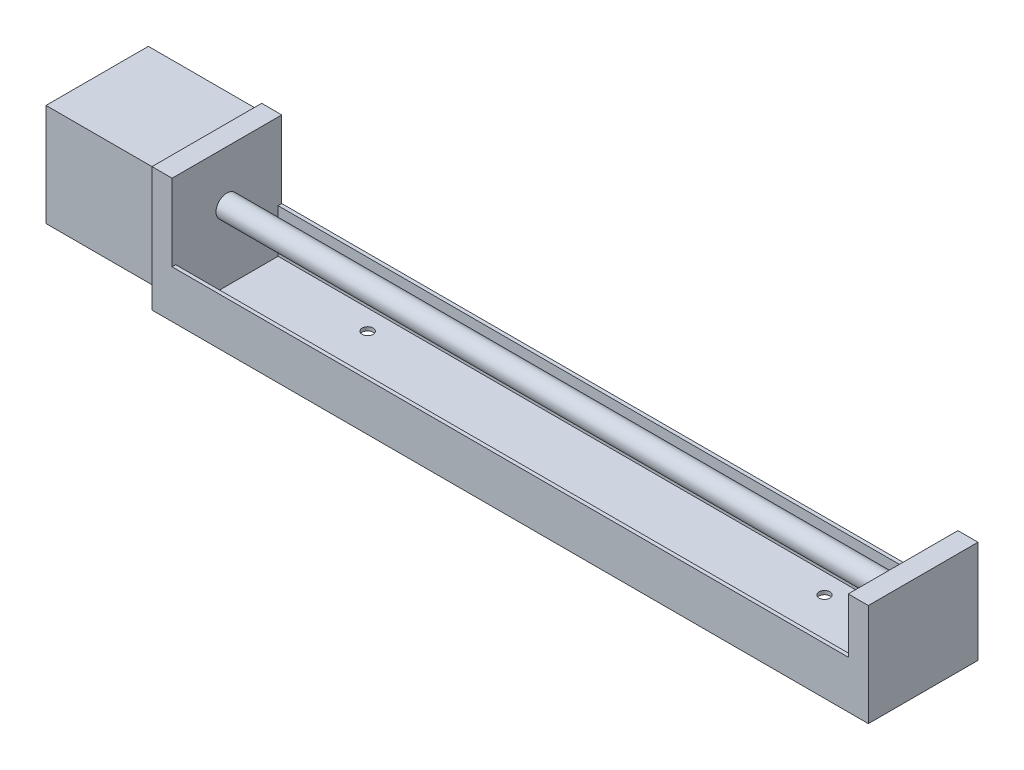
ISO-10303-21;
HEADER;
FILE_DESCRIPTION(('STEP AP214'),'2;1');
FILE_NAME('part.step','',(''),(''),'','','');
FILE_SCHEMA(('AUTOMOTIVE_DESIGN { 1 0 10303 214 1 1 1 1 }'));
ENDSEC;
DATA;
#1=APPLICATION_CONTEXT('core data for automotive mechanical design processes');
#2=APPLICATION_PROTOCOL_DEFINITION('international standard','automotive_design',2000,#1);
#3=PRODUCT_CONTEXT('',#1,'mechanical');
#4=PRODUCT('Part','Part','',(#3));
#5=PRODUCT_RELATED_PRODUCT_CATEGORY('part','',(#4));
#6=PRODUCT_DEFINITION_FORMATION('','',#4);
#7=PRODUCT_DEFINITION_CONTEXT('part definition',#1,'design');
#8=PRODUCT_DEFINITION('design','',#6,#7);
#9=PRODUCT_DEFINITION_SHAPE('','',#8);
#10=(LENGTH_UNIT() NAMED_UNIT(*) SI_UNIT(.MILLI.,.METRE.));
#11=(NAMED_UNIT(*) PLANE_ANGLE_UNIT() SI_UNIT($,.RADIAN.));
#12=(NAMED_UNIT(*) SI_UNIT($,.STERADIAN.) SOLID_ANGLE_UNIT());
#13=UNCERTAINTY_MEASURE_WITH_UNIT(LENGTH_MEASURE(1.E-05),#10,'distance_accuracy_value','');
#14=(GEOMETRIC_REPRESENTATION_CONTEXT(3) GLOBAL_UNCERTAINTY_ASSIGNED_CONTEXT((#13)) GLOBAL_UNIT_ASSIGNED_CONTEXT((#10,
#11,#12)) REPRESENTATION_CONTEXT('',''));
#15=CARTESIAN_POINT('',(0.,0.,0.));
#16=DIRECTION('',(0.,0.,1.));
#17=DIRECTION('',(1.,0.,0.));
#18=AXIS2_PLACEMENT_3D('',#15,#16,#17);
#19=CARTESIAN_POINT('',(-15.,14.,14.));
#20=DIRECTION('',(0.,-1.,0.));
#21=DIRECTION('',(0.,0.,-1.));
#22=AXIS2_PLACEMENT_3D('',#19,#20,#21);
#23=PLANE('',#22);
#24=DIRECTION('',(-1.,0.,0.));
#25=VECTOR('',#24,1.);
#26=CARTESIAN_POINT('',(-15.,14.,-14.));
#27=LINE('',#26,#25);
#28=CARTESIAN_POINT('',(15.,14.,-14.));
#29=VERTEX_POINT('',#28);
#30=CARTESIAN_POINT('',(-15.,14.,-14.));
#31=VERTEX_POINT('',#30);
#32=EDGE_CURVE('E278',#29,#31,#27,.T.);
#33=ORIENTED_EDGE('',*,*,#32,.T.);
#34=DIRECTION('',(0.,0.,-1.));
#35=VECTOR('',#34,1.);
#36=CARTESIAN_POINT('',(-15.,14.,14.));
#37=LINE('',#36,#35);
#38=CARTESIAN_POINT('',(-15.,14.,14.));
#39=VERTEX_POINT('',#38);
#40=EDGE_CURVE('E289',#39,#31,#37,.T.);
#41=ORIENTED_EDGE('',*,*,#40,.F.);
#42=DIRECTION('',(-1.,0.,0.));
#43=VECTOR('',#42,1.);
#44=CARTESIAN_POINT('',(-15.,14.,14.));
#45=LINE('',#44,#43);
#46=CARTESIAN_POINT('',(15.,14.,14.));
#47=VERTEX_POINT('',#46);
#48=EDGE_CURVE('E268',#47,#39,#45,.T.);
#49=ORIENTED_EDGE('',*,*,#48,.F.);
#50=DIRECTION('',(0.,0.,-1.));
#51=VECTOR('',#50,1.);
#52=CARTESIAN_POINT('',(15.,14.,14.));
#53=LINE('',#52,#51);
#54=EDGE_CURVE('E292',#47,#29,#53,.T.);
#55=ORIENTED_EDGE('',*,*,#54,.T.);
#56=EDGE_LOOP('',(#33,#41,#49,#55));
#57=FACE_BOUND('',#56,.T.);
#58=ADVANCED_FACE('F45',(#57),#23,.F.);
#59=CARTESIAN_POINT('',(-15.,-14.,14.));
#60=DIRECTION('',(1.,0.,0.));
#61=DIRECTION('',(0.,0.,-1.));
#62=AXIS2_PLACEMENT_3D('',#59,#60,#61);
#63=PLANE('',#62);
#64=DIRECTION('',(0.,-1.,0.));
#65=VECTOR('',#64,1.);
#66=CARTESIAN_POINT('',(-15.,-14.,-14.));
#67=LINE('',#66,#65);
#68=CARTESIAN_POINT('',(-15.,-14.,-14.));
#69=VERTEX_POINT('',#68);
#70=EDGE_CURVE('E280',#31,#69,#67,.T.);
#71=ORIENTED_EDGE('',*,*,#70,.T.);
#72=DIRECTION('',(0.,0.,-1.));
#73=VECTOR('',#72,1.);
#74=CARTESIAN_POINT('',(-15.,-14.,14.));
#75=LINE('',#74,#73);
#76=CARTESIAN_POINT('',(-15.,-14.,14.));
#77=VERTEX_POINT('',#76);
#78=EDGE_CURVE('E286',#77,#69,#75,.T.);
#79=ORIENTED_EDGE('',*,*,#78,.F.);
#80=DIRECTION('',(0.,-1.,0.));
#81=VECTOR('',#80,1.);
#82=CARTESIAN_POINT('',(-15.,-14.,14.));
#83=LINE('',#82,#81);
#84=EDGE_CURVE('E271',#39,#77,#83,.T.);
#85=ORIENTED_EDGE('',*,*,#84,.F.);
#86=ORIENTED_EDGE('',*,*,#40,.T.);
#87=EDGE_LOOP('',(#71,#79,#85,#86));
#88=FACE_BOUND('',#87,.T.);
#89=ADVANCED_FACE('F325',(#88),#63,.F.);
#90=CARTESIAN_POINT('',(-15.,-14.,14.));
#91=DIRECTION('',(0.,1.,0.));
#92=DIRECTION('',(0.,0.,1.));
#93=AXIS2_PLACEMENT_3D('',#90,#91,#92);
#94=PLANE('',#93);
#95=DIRECTION('',(1.,0.,0.));
#96=VECTOR('',#95,1.);
#97=CARTESIAN_POINT('',(-15.,-14.,-14.));
#98=LINE('',#97,#96);
#99=CARTESIAN_POINT('',(15.,-14.,-14.));
#100=VERTEX_POINT('',#99);
#101=EDGE_CURVE('E269',#69,#100,#98,.T.);
#102=ORIENTED_EDGE('',*,*,#101,.T.);
#103=DIRECTION('',(0.,0.,-1.));
#104=VECTOR('',#103,1.);
#105=CARTESIAN_POINT('',(15.,-14.,14.));
#106=LINE('',#105,#104);
#107=CARTESIAN_POINT('',(15.,-14.,14.));
#108=VERTEX_POINT('',#107);
#109=EDGE_CURVE('E275',#108,#100,#106,.T.);
#110=ORIENTED_EDGE('',*,*,#109,.F.);
#111=DIRECTION('',(1.,0.,0.));
#112=VECTOR('',#111,1.);
#113=CARTESIAN_POINT('',(-15.,-14.,14.));
#114=LINE('',#113,#112);
#115=EDGE_CURVE('E273',#77,#108,#114,.T.);
#116=ORIENTED_EDGE('',*,*,#115,.F.);
#117=ORIENTED_EDGE('',*,*,#78,.T.);
#118=EDGE_LOOP('',(#102,#110,#116,#117));
#119=FACE_BOUND('',#118,.T.);
#120=ADVANCED_FACE('F331',(#119),#94,.F.);
#121=CARTESIAN_POINT('',(0.,0.,14.));
#122=DIRECTION('',(0.,0.,-1.));
#123=DIRECTION('',(-1.,0.,0.));
#124=AXIS2_PLACEMENT_3D('',#121,#122,#123);
#125=PLANE('',#124);
#126=DIRECTION('',(0.,1.,0.));
#127=VECTOR('',#126,1.);
#128=CARTESIAN_POINT('',(15.,-14.,14.));
#129=LINE('',#128,#127);
#130=EDGE_CURVE('E265',#108,#47,#129,.T.);
#131=ORIENTED_EDGE('',*,*,#130,.T.);
#132=ORIENTED_EDGE('',*,*,#48,.T.);
#133=ORIENTED_EDGE('',*,*,#84,.T.);
#134=ORIENTED_EDGE('',*,*,#115,.T.);
#135=EDGE_LOOP('',(#131,#132,#133,#134));
#136=FACE_BOUND('',#135,.T.);
#137=ADVANCED_FACE('F348',(#136),#125,.F.);
#138=CARTESIAN_POINT('',(0.,0.,-14.));
#139=DIRECTION('',(0.,0.,-1.));
#140=DIRECTION('',(-1.,0.,0.));
#141=AXIS2_PLACEMENT_3D('',#138,#139,#140);
#142=PLANE('',#141);
#143=DIRECTION('',(0.,1.,0.));
#144=VECTOR('',#143,1.);
#145=CARTESIAN_POINT('',(15.,-14.,-14.));
#146=LINE('',#145,#144);
#147=EDGE_CURVE('E264',#100,#29,#146,.T.);
#148=ORIENTED_EDGE('',*,*,#147,.F.);
#149=ORIENTED_EDGE('',*,*,#101,.F.);
#150=ORIENTED_EDGE('',*,*,#70,.F.);
#151=ORIENTED_EDGE('',*,*,#32,.F.);
#152=EDGE_LOOP('',(#148,#149,#150,#151));
#153=FACE_BOUND('',#152,.T.);
#154=ADVANCED_FACE('F340',(#153),#142,.T.);
#155=CARTESIAN_POINT('',(15.,0.,0.));
#156=DIRECTION('',(1.,0.,0.));
#157=DIRECTION('',(0.,0.,-1.));
#158=AXIS2_PLACEMENT_3D('',#155,#156,#157);
#159=PLANE('',#158);
#160=DIRECTION('',(0.,0.,-1.));
#161=VECTOR('',#160,1.);
#162=CARTESIAN_POINT('',(15.,-19.,15.));
#163=LINE('',#162,#161);
#164=CARTESIAN_POINT('',(15.,-19.,15.));
#165=VERTEX_POINT('',#164);
#166=CARTESIAN_POINT('',(15.,-19.,-15.));
#167=VERTEX_POINT('',#166);
#168=EDGE_CURVE('E247',#165,#167,#163,.T.);
#169=ORIENTED_EDGE('',*,*,#168,.F.);
#170=DIRECTION('',(0.,-1.,0.));
#171=VECTOR('',#170,1.);
#172=CARTESIAN_POINT('',(15.,15.,15.));
#173=LINE('',#172,#171);
#174=CARTESIAN_POINT('',(15.,15.,15.));
#175=VERTEX_POINT('',#174);
#176=EDGE_CURVE('E165',#175,#165,#173,.T.);
#177=ORIENTED_EDGE('',*,*,#176,.F.);
#178=DIRECTION('',(0.,0.,1.));
#179=VECTOR('',#178,1.);
#180=CARTESIAN_POINT('',(15.,15.,-15.));
#181=LINE('',#180,#179);
#182=CARTESIAN_POINT('',(15.,15.,-15.));
#183=VERTEX_POINT('',#182);
#184=EDGE_CURVE('E256',#183,#175,#181,.T.);
#185=ORIENTED_EDGE('',*,*,#184,.F.);
#186=DIRECTION('',(0.,1.,0.));
#187=VECTOR('',#186,1.);
#188=CARTESIAN_POINT('',(15.,-19.,-15.));
#189=LINE('',#188,#187);
#190=EDGE_CURVE('E254',#167,#183,#189,.T.);
#191=ORIENTED_EDGE('',*,*,#190,.F.);
#192=EDGE_LOOP('',(#169,#177,#185,#191));
#193=FACE_BOUND('',#192,.T.);
#194=ORIENTED_EDGE('',*,*,#109,.T.);
#195=ORIENTED_EDGE('',*,*,#147,.T.);
#196=ORIENTED_EDGE('',*,*,#54,.F.);
#197=ORIENTED_EDGE('',*,*,#130,.F.);
#198=EDGE_LOOP('',(#194,#195,#196,#197));
#199=FACE_BOUND('',#198,.T.);
#200=ADVANCED_FACE('F346',(#193,#199),#159,.F.);
#201=CARTESIAN_POINT('',(20.5,-19.,15.));
#202=DIRECTION('',(0.,1.,0.));
#203=DIRECTION('',(0.,0.,1.));
#204=AXIS2_PLACEMENT_3D('',#201,#202,#203);
#205=PLANE('',#204);
#206=CARTESIAN_POINT('',(50.5,-19.,-8.49999999999999));
#207=DIRECTION('',(0.,-1.,0.));
#208=DIRECTION('',(0.,0.,-1.));
#209=AXIS2_PLACEMENT_3D('',#206,#207,#208);
#210=CIRCLE('',#209,1.5);
#211=CARTESIAN_POINT('',(50.5,-19.,-10.));
#212=VERTEX_POINT('',#211);
#213=EDGE_CURVE('E445',#212,#212,#210,.T.);
#214=ORIENTED_EDGE('',*,*,#213,.F.);
#215=EDGE_LOOP('',(#214));
#216=FACE_BOUND('',#215,.T.);
#217=CARTESIAN_POINT('',(175.5,-19.,-8.49999999999999));
#218=DIRECTION('',(0.,-1.,0.));
#219=DIRECTION('',(0.,0.,-1.));
#220=AXIS2_PLACEMENT_3D('',#217,#218,#219);
#221=CIRCLE('',#220,1.5);
#222=CARTESIAN_POINT('',(175.5,-19.,-9.99999999999999));
#223=VERTEX_POINT('',#222);
#224=EDGE_CURVE('E441',#223,#223,#221,.T.);
#225=ORIENTED_EDGE('',*,*,#224,.F.);
#226=EDGE_LOOP('',(#225));
#227=FACE_BOUND('',#226,.T.);
#228=CARTESIAN_POINT('',(175.5,-19.,8.50000000000001));
#229=DIRECTION('',(0.,-1.,0.));
#230=DIRECTION('',(0.,0.,-1.));
#231=AXIS2_PLACEMENT_3D('',#228,#229,#230);
#232=CIRCLE('',#231,1.5);
#233=CARTESIAN_POINT('',(175.5,-19.,7.00000000000001));
#234=VERTEX_POINT('',#233);
#235=EDGE_CURVE('E439',#234,#234,#232,.T.);
#236=ORIENTED_EDGE('',*,*,#235,.F.);
#237=EDGE_LOOP('',(#236));
#238=FACE_BOUND('',#237,.T.);
#239=CARTESIAN_POINT('',(50.5,-19.,8.50000000000001));
#240=DIRECTION('',(0.,-1.,0.));
#241=DIRECTION('',(0.,0.,-1.));
#242=AXIS2_PLACEMENT_3D('',#239,#240,#241);
#243=CIRCLE('',#242,1.5);
#244=CARTESIAN_POINT('',(50.5,-19.,7.));
#245=VERTEX_POINT('',#244);
#246=EDGE_CURVE('E190',#245,#245,#243,.T.);
#247=ORIENTED_EDGE('',*,*,#246,.F.);
#248=EDGE_LOOP('',(#247));
#249=FACE_BOUND('',#248,.T.);
#250=ORIENTED_EDGE('',*,*,#168,.T.);
#251=DIRECTION('',(-1.,0.,0.));
#252=VECTOR('',#251,1.);
#253=CARTESIAN_POINT('',(20.5,-19.,-15.));
#254=LINE('',#253,#252);
#255=CARTESIAN_POINT('',(211.,-19.,-15.));
#256=VERTEX_POINT('',#255);
#257=EDGE_CURVE('E176',#256,#167,#254,.T.);
#258=ORIENTED_EDGE('',*,*,#257,.F.);
#259=DIRECTION('',(0.,0.,-1.));
#260=VECTOR('',#259,1.);
#261=CARTESIAN_POINT('',(211.,-19.,15.));
#262=LINE('',#261,#260);
#263=CARTESIAN_POINT('',(211.,-19.,15.));
#264=VERTEX_POINT('',#263);
#265=EDGE_CURVE('E173',#264,#256,#262,.T.);
#266=ORIENTED_EDGE('',*,*,#265,.F.);
#267=DIRECTION('',(-1.,0.,0.));
#268=VECTOR('',#267,1.);
#269=CARTESIAN_POINT('',(20.5,-19.,15.));
#270=LINE('',#269,#268);
#271=EDGE_CURVE('E157',#264,#165,#270,.T.);
#272=ORIENTED_EDGE('',*,*,#271,.T.);
#273=EDGE_LOOP('',(#250,#258,#266,#272));
#274=FACE_BOUND('',#273,.T.);
#275=ADVANCED_FACE('F174',(#216,#227,#238,#249,#274),#205,.F.);
#276=CARTESIAN_POINT('',(20.5,-19.,-15.));
#277=DIRECTION('',(0.,0.,1.));
#278=DIRECTION('',(1.,0.,0.));
#279=AXIS2_PLACEMENT_3D('',#276,#277,#278);
#280=PLANE('',#279);
#281=ORIENTED_EDGE('',*,*,#190,.T.);
#282=DIRECTION('',(-1.,0.,0.));
#283=VECTOR('',#282,1.);
#284=CARTESIAN_POINT('',(20.5,15.,-15.));
#285=LINE('',#284,#283);
#286=CARTESIAN_POINT('',(20.5,15.,-15.));
#287=VERTEX_POINT('',#286);
#288=EDGE_CURVE('E260',#287,#183,#285,.T.);
#289=ORIENTED_EDGE('',*,*,#288,.F.);
#290=DIRECTION('',(0.,1.,0.));
#291=VECTOR('',#290,1.);
#292=CARTESIAN_POINT('',(20.5,-19.,-15.));
#293=LINE('',#292,#291);
#294=CARTESIAN_POINT('',(20.5,-6.,-15.));
#295=VERTEX_POINT('',#294);
#296=EDGE_CURVE('E248',#295,#287,#293,.T.);
#297=ORIENTED_EDGE('',*,*,#296,.F.);
#298=DIRECTION('',(-1.,0.,0.));
#299=VECTOR('',#298,1.);
#300=CARTESIAN_POINT('',(205.5,-6.,-15.));
#301=LINE('',#300,#299);
#302=CARTESIAN_POINT('',(205.5,-6.,-15.));
#303=VERTEX_POINT('',#302);
#304=EDGE_CURVE('E220',#303,#295,#301,.T.);
#305=ORIENTED_EDGE('',*,*,#304,.F.);
#306=DIRECTION('',(0.,1.,0.));
#307=VECTOR('',#306,1.);
#308=CARTESIAN_POINT('',(205.5,-19.,-15.));
#309=LINE('',#308,#307);
#310=CARTESIAN_POINT('',(205.5,9.,-15.));
#311=VERTEX_POINT('',#310);
#312=EDGE_CURVE('E187',#303,#311,#309,.T.);
#313=ORIENTED_EDGE('',*,*,#312,.T.);
#314=DIRECTION('',(-1.,0.,0.));
#315=VECTOR('',#314,1.);
#316=CARTESIAN_POINT('',(211.,9.,-15.));
#317=LINE('',#316,#315);
#318=CARTESIAN_POINT('',(211.,9.,-15.));
#319=VERTEX_POINT('',#318);
#320=EDGE_CURVE('E201',#319,#311,#317,.T.);
#321=ORIENTED_EDGE('',*,*,#320,.F.);
#322=DIRECTION('',(0.,1.,0.));
#323=VECTOR('',#322,1.);
#324=CARTESIAN_POINT('',(211.,-19.,-15.));
#325=LINE('',#324,#323);
#326=EDGE_CURVE('E179',#256,#319,#325,.T.);
#327=ORIENTED_EDGE('',*,*,#326,.F.);
#328=ORIENTED_EDGE('',*,*,#257,.T.);
#329=EDGE_LOOP('',(#281,#289,#297,#305,#313,#321,#327,#328));
#330=FACE_BOUND('',#329,.T.);
#331=ADVANCED_FACE('F359',(#330),#280,.F.);
#332=CARTESIAN_POINT('',(20.5,15.,-15.));
#333=DIRECTION('',(0.,-1.,0.));
#334=DIRECTION('',(0.,0.,-1.));
#335=AXIS2_PLACEMENT_3D('',#332,#333,#334);
#336=PLANE('',#335);
#337=ORIENTED_EDGE('',*,*,#184,.T.);
#338=DIRECTION('',(-1.,0.,0.));
#339=VECTOR('',#338,1.);
#340=CARTESIAN_POINT('',(20.5,15.,15.));
#341=LINE('',#340,#339);
#342=CARTESIAN_POINT('',(20.5,15.,15.));
#343=VERTEX_POINT('',#342);
#344=EDGE_CURVE('E169',#343,#175,#341,.T.);
#345=ORIENTED_EDGE('',*,*,#344,.F.);
#346=DIRECTION('',(0.,0.,1.));
#347=VECTOR('',#346,1.);
#348=CARTESIAN_POINT('',(20.5,15.,-15.));
#349=LINE('',#348,#347);
#350=EDGE_CURVE('E250',#287,#343,#349,.T.);
#351=ORIENTED_EDGE('',*,*,#350,.F.);
#352=ORIENTED_EDGE('',*,*,#288,.T.);
#353=EDGE_LOOP('',(#337,#345,#351,#352));
#354=FACE_BOUND('',#353,.T.);
#355=ADVANCED_FACE('F363',(#354),#336,.F.);
#356=CARTESIAN_POINT('',(20.5,15.,15.));
#357=DIRECTION('',(0.,0.,-1.));
#358=DIRECTION('',(0.,1.,0.));
#359=AXIS2_PLACEMENT_3D('',#356,#357,#358);
#360=PLANE('',#359);
#361=ORIENTED_EDGE('',*,*,#176,.T.);
#362=ORIENTED_EDGE('',*,*,#271,.F.);
#363=DIRECTION('',(0.,-1.,0.));
#364=VECTOR('',#363,1.);
#365=CARTESIAN_POINT('',(211.,-19.,15.));
#366=LINE('',#365,#364);
#367=CARTESIAN_POINT('',(211.,9.,15.));
#368=VERTEX_POINT('',#367);
#369=EDGE_CURVE('E162',#368,#264,#366,.T.);
#370=ORIENTED_EDGE('',*,*,#369,.F.);
#371=DIRECTION('',(-1.,0.,0.));
#372=VECTOR('',#371,1.);
#373=CARTESIAN_POINT('',(211.,9.,15.));
#374=LINE('',#373,#372);
#375=CARTESIAN_POINT('',(205.5,9.,15.));
#376=VERTEX_POINT('',#375);
#377=EDGE_CURVE('E195',#368,#376,#374,.T.);
#378=ORIENTED_EDGE('',*,*,#377,.T.);
#379=DIRECTION('',(0.,-1.,0.));
#380=VECTOR('',#379,1.);
#381=CARTESIAN_POINT('',(205.5,-19.,15.));
#382=LINE('',#381,#380);
#383=CARTESIAN_POINT('',(205.5,-6.,15.));
#384=VERTEX_POINT('',#383);
#385=EDGE_CURVE('E196',#376,#384,#382,.T.);
#386=ORIENTED_EDGE('',*,*,#385,.T.);
#387=DIRECTION('',(-1.,0.,0.));
#388=VECTOR('',#387,1.);
#389=CARTESIAN_POINT('',(205.5,-6.,15.));
#390=LINE('',#389,#388);
#391=CARTESIAN_POINT('',(20.5,-6.00000000000001,15.));
#392=VERTEX_POINT('',#391);
#393=EDGE_CURVE('E232',#384,#392,#390,.T.);
#394=ORIENTED_EDGE('',*,*,#393,.T.);
#395=DIRECTION('',(0.,-1.,0.));
#396=VECTOR('',#395,1.);
#397=CARTESIAN_POINT('',(20.5,15.,15.));
#398=LINE('',#397,#396);
#399=EDGE_CURVE('E170',#343,#392,#398,.T.);
#400=ORIENTED_EDGE('',*,*,#399,.F.);
#401=ORIENTED_EDGE('',*,*,#344,.T.);
#402=EDGE_LOOP('',(#361,#362,#370,#378,#386,#394,#400,#401));
#403=FACE_BOUND('',#402,.T.);
#404=ADVANCED_FACE('F159',(#403),#360,.F.);
#405=CARTESIAN_POINT('',(20.5,0.,0.));
#406=DIRECTION('',(1.,0.,0.));
#407=DIRECTION('',(0.,0.,-1.));
#408=AXIS2_PLACEMENT_3D('',#405,#406,#407);
#409=PLANE('',#408);
#410=CARTESIAN_POINT('',(20.5,0.999999999999998,0.));
#411=DIRECTION('',(1.,0.,0.));
#412=DIRECTION('',(0.,0.,-1.));
#413=AXIS2_PLACEMENT_3D('',#410,#411,#412);
#414=CIRCLE('',#413,3.);
#415=CARTESIAN_POINT('',(20.5,0.999999999999998,-3.));
#416=VERTEX_POINT('',#415);
#417=EDGE_CURVE('E11',#416,#416,#414,.T.);
#418=ORIENTED_EDGE('',*,*,#417,.F.);
#419=EDGE_LOOP('',(#418));
#420=FACE_BOUND('',#419,.T.);
#421=DIRECTION('',(0.,0.,1.));
#422=VECTOR('',#421,1.);
#423=CARTESIAN_POINT('',(20.5,-6.,-14.));
#424=LINE('',#423,#422);
#425=CARTESIAN_POINT('',(20.5,-6.,-14.));
#426=VERTEX_POINT('',#425);
#427=EDGE_CURVE('E204',#295,#426,#424,.T.);
#428=ORIENTED_EDGE('',*,*,#427,.F.);
#429=ORIENTED_EDGE('',*,*,#296,.T.);
#430=ORIENTED_EDGE('',*,*,#350,.T.);
#431=ORIENTED_EDGE('',*,*,#399,.T.);
#432=DIRECTION('',(0.,0.,1.));
#433=VECTOR('',#432,1.);
#434=CARTESIAN_POINT('',(20.5,-6.,15.));
#435=LINE('',#434,#433);
#436=CARTESIAN_POINT('',(20.5,-6.,14.));
#437=VERTEX_POINT('',#436);
#438=EDGE_CURVE('E61',#437,#392,#435,.T.);
#439=ORIENTED_EDGE('',*,*,#438,.F.);
#440=DIRECTION('',(0.,1.,0.));
#441=VECTOR('',#440,1.);
#442=CARTESIAN_POINT('',(20.5,-6.,14.));
#443=LINE('',#442,#441);
#444=CARTESIAN_POINT('',(20.5,-18.,14.));
#445=VERTEX_POINT('',#444);
#446=EDGE_CURVE('E65',#445,#437,#443,.T.);
#447=ORIENTED_EDGE('',*,*,#446,.F.);
#448=DIRECTION('',(0.,0.,1.));
#449=VECTOR('',#448,1.);
#450=CARTESIAN_POINT('',(20.5,-18.,14.));
#451=LINE('',#450,#449);
#452=CARTESIAN_POINT('',(20.5,-18.,-14.));
#453=VERTEX_POINT('',#452);
#454=EDGE_CURVE('E226',#453,#445,#451,.T.);
#455=ORIENTED_EDGE('',*,*,#454,.F.);
#456=DIRECTION('',(0.,-1.,0.));
#457=VECTOR('',#456,1.);
#458=CARTESIAN_POINT('',(20.5,-18.,-14.));
#459=LINE('',#458,#457);
#460=EDGE_CURVE('E223',#426,#453,#459,.T.);
#461=ORIENTED_EDGE('',*,*,#460,.F.);
#462=EDGE_LOOP('',(#428,#429,#430,#431,#439,#447,#455,#461));
#463=FACE_BOUND('',#462,.T.);
#464=ADVANCED_FACE('F370',(#420,#463),#409,.T.);
#465=CARTESIAN_POINT('',(205.5,-6.,-14.));
#466=DIRECTION('',(0.,-1.,0.));
#467=DIRECTION('',(0.,0.,-1.));
#468=AXIS2_PLACEMENT_3D('',#465,#466,#467);
#469=PLANE('',#468);
#470=ORIENTED_EDGE('',*,*,#427,.T.);
#471=DIRECTION('',(-1.,0.,0.));
#472=VECTOR('',#471,1.);
#473=CARTESIAN_POINT('',(205.5,-6.,-14.));
#474=LINE('',#473,#472);
#475=CARTESIAN_POINT('',(205.5,-6.,-14.));
#476=VERTEX_POINT('',#475);
#477=EDGE_CURVE('E244',#476,#426,#474,.T.);
#478=ORIENTED_EDGE('',*,*,#477,.F.);
#479=DIRECTION('',(0.,0.,1.));
#480=VECTOR('',#479,1.);
#481=CARTESIAN_POINT('',(205.5,-6.,-14.));
#482=LINE('',#481,#480);
#483=EDGE_CURVE('E205',#303,#476,#482,.T.);
#484=ORIENTED_EDGE('',*,*,#483,.F.);
#485=ORIENTED_EDGE('',*,*,#304,.T.);
#486=EDGE_LOOP('',(#470,#478,#484,#485));
#487=FACE_BOUND('',#486,.T.);
#488=ADVANCED_FACE('F376',(#487),#469,.F.);
#489=CARTESIAN_POINT('',(205.5,-18.,-14.));
#490=DIRECTION('',(0.,0.,-1.));
#491=DIRECTION('',(-1.,0.,0.));
#492=AXIS2_PLACEMENT_3D('',#489,#490,#491);
#493=PLANE('',#492);
#494=ORIENTED_EDGE('',*,*,#460,.T.);
#495=DIRECTION('',(-1.,0.,0.));
#496=VECTOR('',#495,1.);
#497=CARTESIAN_POINT('',(205.5,-18.,-14.));
#498=LINE('',#497,#496);
#499=CARTESIAN_POINT('',(205.5,-18.,-14.));
#500=VERTEX_POINT('',#499);
#501=EDGE_CURVE('E241',#500,#453,#498,.T.);
#502=ORIENTED_EDGE('',*,*,#501,.F.);
#503=DIRECTION('',(0.,-1.,0.));
#504=VECTOR('',#503,1.);
#505=CARTESIAN_POINT('',(205.5,-18.,-14.));
#506=LINE('',#505,#504);
#507=EDGE_CURVE('E208',#476,#500,#506,.T.);
#508=ORIENTED_EDGE('',*,*,#507,.F.);
#509=ORIENTED_EDGE('',*,*,#477,.T.);
#510=EDGE_LOOP('',(#494,#502,#508,#509));
#511=FACE_BOUND('',#510,.T.);
#512=ADVANCED_FACE('F380',(#511),#493,.F.);
#513=CARTESIAN_POINT('',(205.5,-18.,14.));
#514=DIRECTION('',(0.,-1.,0.));
#515=DIRECTION('',(0.,0.,-1.));
#516=AXIS2_PLACEMENT_3D('',#513,#514,#515);
#517=PLANE('',#516);
#518=CARTESIAN_POINT('',(50.5,-18.,-8.49999999999999));
#519=DIRECTION('',(0.,-1.,0.));
#520=DIRECTION('',(0.,0.,-1.));
#521=AXIS2_PLACEMENT_3D('',#518,#519,#520);
#522=CIRCLE('',#521,1.5);
#523=CARTESIAN_POINT('',(50.5,-18.,-10.));
#524=VERTEX_POINT('',#523);
#525=EDGE_CURVE('E48',#524,#524,#522,.T.);
#526=ORIENTED_EDGE('',*,*,#525,.T.);
#527=EDGE_LOOP('',(#526));
#528=FACE_BOUND('',#527,.T.);
#529=CARTESIAN_POINT('',(175.5,-18.,-8.49999999999999));
#530=DIRECTION('',(0.,-1.,0.));
#531=DIRECTION('',(0.,0.,-1.));
#532=AXIS2_PLACEMENT_3D('',#529,#530,#531);
#533=CIRCLE('',#532,1.5);
#534=CARTESIAN_POINT('',(175.5,-18.,-9.99999999999999));
#535=VERTEX_POINT('',#534);
#536=EDGE_CURVE('E302',#535,#535,#533,.T.);
#537=ORIENTED_EDGE('',*,*,#536,.T.);
#538=EDGE_LOOP('',(#537));
#539=FACE_BOUND('',#538,.T.);
#540=CARTESIAN_POINT('',(175.5,-18.,8.50000000000001));
#541=DIRECTION('',(0.,-1.,0.));
#542=DIRECTION('',(0.,0.,-1.));
#543=AXIS2_PLACEMENT_3D('',#540,#541,#542);
#544=CIRCLE('',#543,1.5);
#545=CARTESIAN_POINT('',(175.5,-18.,7.00000000000001));
#546=VERTEX_POINT('',#545);
#547=EDGE_CURVE('E300',#546,#546,#544,.T.);
#548=ORIENTED_EDGE('',*,*,#547,.T.);
#549=EDGE_LOOP('',(#548));
#550=FACE_BOUND('',#549,.T.);
#551=CARTESIAN_POINT('',(50.5,-18.,8.50000000000001));
#552=DIRECTION('',(0.,-1.,0.));
#553=DIRECTION('',(0.,0.,-1.));
#554=AXIS2_PLACEMENT_3D('',#551,#552,#553);
#555=CIRCLE('',#554,1.5);
#556=CARTESIAN_POINT('',(50.5,-18.,7.));
#557=VERTEX_POINT('',#556);
#558=EDGE_CURVE('E297',#557,#557,#555,.T.);
#559=ORIENTED_EDGE('',*,*,#558,.T.);
#560=EDGE_LOOP('',(#559));
#561=FACE_BOUND('',#560,.T.);
#562=ORIENTED_EDGE('',*,*,#454,.T.);
#563=DIRECTION('',(-1.,0.,0.));
#564=VECTOR('',#563,1.);
#565=CARTESIAN_POINT('',(205.5,-18.,14.));
#566=LINE('',#565,#564);
#567=CARTESIAN_POINT('',(205.5,-18.,14.));
#568=VERTEX_POINT('',#567);
#569=EDGE_CURVE('E238',#568,#445,#566,.T.);
#570=ORIENTED_EDGE('',*,*,#569,.F.);
#571=DIRECTION('',(0.,0.,1.));
#572=VECTOR('',#571,1.);
#573=CARTESIAN_POINT('',(205.5,-18.,14.));
#574=LINE('',#573,#572);
#575=EDGE_CURVE('E211',#500,#568,#574,.T.);
#576=ORIENTED_EDGE('',*,*,#575,.F.);
#577=ORIENTED_EDGE('',*,*,#501,.T.);
#578=EDGE_LOOP('',(#562,#570,#576,#577));
#579=FACE_BOUND('',#578,.T.);
#580=ADVANCED_FACE('F309',(#528,#539,#550,#561,#579),#517,.F.);
#581=CARTESIAN_POINT('',(205.5,-6.,14.));
#582=DIRECTION('',(0.,0.,1.));
#583=DIRECTION('',(0.,-1.,0.));
#584=AXIS2_PLACEMENT_3D('',#581,#582,#583);
#585=PLANE('',#584);
#586=ORIENTED_EDGE('',*,*,#446,.T.);
#587=DIRECTION('',(-1.,0.,0.));
#588=VECTOR('',#587,1.);
#589=CARTESIAN_POINT('',(205.5,-6.,14.));
#590=LINE('',#589,#588);
#591=CARTESIAN_POINT('',(205.5,-6.,14.));
#592=VERTEX_POINT('',#591);
#593=EDGE_CURVE('E235',#592,#437,#590,.T.);
#594=ORIENTED_EDGE('',*,*,#593,.F.);
#595=DIRECTION('',(0.,1.,0.));
#596=VECTOR('',#595,1.);
#597=CARTESIAN_POINT('',(205.5,-6.,14.));
#598=LINE('',#597,#596);
#599=EDGE_CURVE('E214',#568,#592,#598,.T.);
#600=ORIENTED_EDGE('',*,*,#599,.F.);
#601=ORIENTED_EDGE('',*,*,#569,.T.);
#602=EDGE_LOOP('',(#586,#594,#600,#601));
#603=FACE_BOUND('',#602,.T.);
#604=ADVANCED_FACE('F387',(#603),#585,.F.);
#605=CARTESIAN_POINT('',(205.5,-6.,15.));
#606=DIRECTION('',(0.,-1.,0.));
#607=DIRECTION('',(0.,0.,-1.));
#608=AXIS2_PLACEMENT_3D('',#605,#606,#607);
#609=PLANE('',#608);
#610=ORIENTED_EDGE('',*,*,#438,.T.);
#611=ORIENTED_EDGE('',*,*,#393,.F.);
#612=DIRECTION('',(0.,0.,1.));
#613=VECTOR('',#612,1.);
#614=CARTESIAN_POINT('',(205.5,-6.,15.));
#615=LINE('',#614,#613);
#616=EDGE_CURVE('E217',#592,#384,#615,.T.);
#617=ORIENTED_EDGE('',*,*,#616,.F.);
#618=ORIENTED_EDGE('',*,*,#593,.T.);
#619=EDGE_LOOP('',(#610,#611,#617,#618));
#620=FACE_BOUND('',#619,.T.);
#621=ADVANCED_FACE('F390',(#620),#609,.F.);
#622=CARTESIAN_POINT('',(211.,9.,15.));
#623=DIRECTION('',(0.,-1.,0.));
#624=DIRECTION('',(0.,0.,-1.));
#625=AXIS2_PLACEMENT_3D('',#622,#623,#624);
#626=PLANE('',#625);
#627=DIRECTION('',(0.,0.,1.));
#628=VECTOR('',#627,1.);
#629=CARTESIAN_POINT('',(205.5,9.,15.));
#630=LINE('',#629,#628);
#631=EDGE_CURVE('E185',#311,#376,#630,.T.);
#632=ORIENTED_EDGE('',*,*,#631,.T.);
#633=ORIENTED_EDGE('',*,*,#377,.F.);
#634=DIRECTION('',(0.,0.,1.));
#635=VECTOR('',#634,1.);
#636=CARTESIAN_POINT('',(211.,9.,15.));
#637=LINE('',#636,#635);
#638=EDGE_CURVE('E183',#319,#368,#637,.T.);
#639=ORIENTED_EDGE('',*,*,#638,.F.);
#640=ORIENTED_EDGE('',*,*,#320,.T.);
#641=EDGE_LOOP('',(#632,#633,#639,#640));
#642=FACE_BOUND('',#641,.T.);
#643=ADVANCED_FACE('F394',(#642),#626,.F.);
#644=CARTESIAN_POINT('',(211.,0.,0.));
#645=DIRECTION('',(-1.,0.,0.));
#646=DIRECTION('',(0.,0.,1.));
#647=AXIS2_PLACEMENT_3D('',#644,#645,#646);
#648=PLANE('',#647);
#649=ORIENTED_EDGE('',*,*,#369,.T.);
#650=ORIENTED_EDGE('',*,*,#265,.T.);
#651=ORIENTED_EDGE('',*,*,#326,.T.);
#652=ORIENTED_EDGE('',*,*,#638,.T.);
#653=EDGE_LOOP('',(#649,#650,#651,#652));
#654=FACE_BOUND('',#653,.T.);
#655=ADVANCED_FACE('F181',(#654),#648,.F.);
#656=CARTESIAN_POINT('',(205.5,0.,0.));
#657=DIRECTION('',(-1.,0.,0.));
#658=DIRECTION('',(0.,0.,1.));
#659=AXIS2_PLACEMENT_3D('',#656,#657,#658);
#660=PLANE('',#659);
#661=CARTESIAN_POINT('',(205.5,0.999999999999998,0.));
#662=DIRECTION('',(-1.,0.,0.));
#663=DIRECTION('',(0.,0.,1.));
#664=AXIS2_PLACEMENT_3D('',#661,#662,#663);
#665=CIRCLE('',#664,3.);
#666=CARTESIAN_POINT('',(205.5,0.999999999999998,3.));
#667=VERTEX_POINT('',#666);
#668=EDGE_CURVE('E53',#667,#667,#665,.T.);
#669=ORIENTED_EDGE('',*,*,#668,.F.);
#670=EDGE_LOOP('',(#669));
#671=FACE_BOUND('',#670,.T.);
#672=ORIENTED_EDGE('',*,*,#312,.F.);
#673=ORIENTED_EDGE('',*,*,#483,.T.);
#674=ORIENTED_EDGE('',*,*,#507,.T.);
#675=ORIENTED_EDGE('',*,*,#575,.T.);
#676=ORIENTED_EDGE('',*,*,#599,.T.);
#677=ORIENTED_EDGE('',*,*,#616,.T.);
#678=ORIENTED_EDGE('',*,*,#385,.F.);
#679=ORIENTED_EDGE('',*,*,#631,.F.);
#680=EDGE_LOOP('',(#672,#673,#674,#675,#676,#677,#678,#679));
#681=FACE_BOUND('',#680,.T.);
#682=ADVANCED_FACE('F399',(#671,#681),#660,.T.);
#683=CARTESIAN_POINT('',(12.0147186257614,0.999999999999998,0.));
#684=DIRECTION('',(1.,0.,0.));
#685=DIRECTION('',(0.,0.,-1.));
#686=AXIS2_PLACEMENT_3D('',#683,#684,#685);
#687=CYLINDRICAL_SURFACE('',#686,3.);
#688=ORIENTED_EDGE('',*,*,#668,.T.);
#689=EDGE_LOOP('',(#688));
#690=FACE_BOUND('',#689,.T.);
#691=ORIENTED_EDGE('',*,*,#417,.T.);
#692=EDGE_LOOP('',(#691));
#693=FACE_BOUND('',#692,.T.);
#694=ADVANCED_FACE('F402',(#690,#693),#687,.T.);
#695=CARTESIAN_POINT('',(50.5,-9.,8.50000000000001));
#696=DIRECTION('',(0.,-1.,0.));
#697=DIRECTION('',(0.,0.,-1.));
#698=AXIS2_PLACEMENT_3D('',#695,#696,#697);
#699=CYLINDRICAL_SURFACE('',#698,1.5);
#700=ORIENTED_EDGE('',*,*,#246,.T.);
#701=EDGE_LOOP('',(#700));
#702=FACE_BOUND('',#701,.T.);
#703=ORIENTED_EDGE('',*,*,#558,.F.);
#704=EDGE_LOOP('',(#703));
#705=FACE_BOUND('',#704,.T.);
#706=ADVANCED_FACE('F407',(#702,#705),#699,.F.);
#707=CARTESIAN_POINT('',(175.5,-9.,8.50000000000001));
#708=DIRECTION('',(0.,-1.,0.));
#709=DIRECTION('',(0.,0.,-1.));
#710=AXIS2_PLACEMENT_3D('',#707,#708,#709);
#711=CYLINDRICAL_SURFACE('',#710,1.5);
#712=ORIENTED_EDGE('',*,*,#235,.T.);
#713=EDGE_LOOP('',(#712));
#714=FACE_BOUND('',#713,.T.);
#715=ORIENTED_EDGE('',*,*,#547,.F.);
#716=EDGE_LOOP('',(#715));
#717=FACE_BOUND('',#716,.T.);
#718=ADVANCED_FACE('F319',(#714,#717),#711,.F.);
#719=CARTESIAN_POINT('',(175.5,-9.,-8.49999999999999));
#720=DIRECTION('',(0.,-1.,0.));
#721=DIRECTION('',(0.,0.,-1.));
#722=AXIS2_PLACEMENT_3D('',#719,#720,#721);
#723=CYLINDRICAL_SURFACE('',#722,1.5);
#724=ORIENTED_EDGE('',*,*,#224,.T.);
#725=EDGE_LOOP('',(#724));
#726=FACE_BOUND('',#725,.T.);
#727=ORIENTED_EDGE('',*,*,#536,.F.);
#728=EDGE_LOOP('',(#727));
#729=FACE_BOUND('',#728,.T.);
#730=ADVANCED_FACE('F313',(#726,#729),#723,.F.);
#731=CARTESIAN_POINT('',(50.5,-9.,-8.49999999999999));
#732=DIRECTION('',(0.,-1.,0.));
#733=DIRECTION('',(0.,0.,-1.));
#734=AXIS2_PLACEMENT_3D('',#731,#732,#733);
#735=CYLINDRICAL_SURFACE('',#734,1.5);
#736=ORIENTED_EDGE('',*,*,#213,.T.);
#737=EDGE_LOOP('',(#736));
#738=FACE_BOUND('',#737,.T.);
#739=ORIENTED_EDGE('',*,*,#525,.F.);
#740=EDGE_LOOP('',(#739));
#741=FACE_BOUND('',#740,.T.);
#742=ADVANCED_FACE('F311',(#738,#741),#735,.F.);
#743=CLOSED_SHELL('',(#58,#89,#120,#137,#154,#200,#275,#331,#355,#404,#464,#488,#512,#580,#604,
#621,#643,#655,#682,#694,#706,#718,#730,#742));
#744=MANIFOLD_SOLID_BREP('B2',#743);
#745=ADVANCED_BREP_SHAPE_REPRESENTATION('',(#18,#744),#14);
#746=SHAPE_DEFINITION_REPRESENTATION(#9,#745);
ENDSEC;
END-ISO-10303-21;
